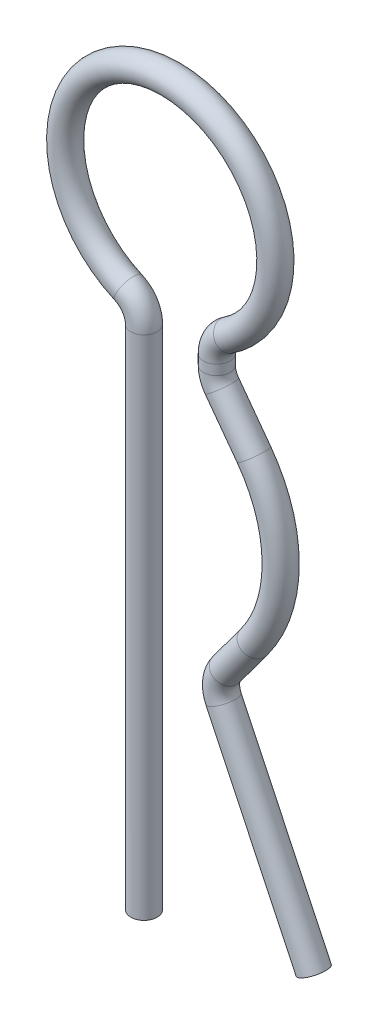
ISO-10303-21;
HEADER;
FILE_DESCRIPTION(('STEP AP214'),'2;1');
FILE_NAME('part.step','',(''),(''),'','','');
FILE_SCHEMA(('AUTOMOTIVE_DESIGN { 1 0 10303 214 1 1 1 1 }'));
ENDSEC;
DATA;
#1=APPLICATION_CONTEXT('core data for automotive mechanical design processes');
#2=APPLICATION_PROTOCOL_DEFINITION('international standard','automotive_design',2000,#1);
#3=PRODUCT_CONTEXT('',#1,'mechanical');
#4=PRODUCT('Part','Part','',(#3));
#5=PRODUCT_RELATED_PRODUCT_CATEGORY('part','',(#4));
#6=PRODUCT_DEFINITION_FORMATION('','',#4);
#7=PRODUCT_DEFINITION_CONTEXT('part definition',#1,'design');
#8=PRODUCT_DEFINITION('design','',#6,#7);
#9=PRODUCT_DEFINITION_SHAPE('','',#8);
#10=(LENGTH_UNIT() NAMED_UNIT(*) SI_UNIT(.MILLI.,.METRE.));
#11=(NAMED_UNIT(*) PLANE_ANGLE_UNIT() SI_UNIT($,.RADIAN.));
#12=(NAMED_UNIT(*) SI_UNIT($,.STERADIAN.) SOLID_ANGLE_UNIT());
#13=UNCERTAINTY_MEASURE_WITH_UNIT(LENGTH_MEASURE(1.E-05),#10,'distance_accuracy_value','');
#14=(GEOMETRIC_REPRESENTATION_CONTEXT(3) GLOBAL_UNCERTAINTY_ASSIGNED_CONTEXT((#13)) GLOBAL_UNIT_ASSIGNED_CONTEXT((#10,
#11,#12)) REPRESENTATION_CONTEXT('',''));
#15=CARTESIAN_POINT('',(0.,0.,0.));
#16=DIRECTION('',(0.,0.,1.));
#17=DIRECTION('',(1.,0.,0.));
#18=AXIS2_PLACEMENT_3D('',#15,#16,#17);
#19=CARTESIAN_POINT('',(1.51338467965908,-2.7721512833438,0.));
#20=DIRECTION('',(0.42874959723389,-0.903423368566353,0.));
#21=DIRECTION('',(0.903423368566353,0.42874959723389,0.));
#22=AXIS2_PLACEMENT_3D('',#19,#20,#21);
#23=CYLINDRICAL_SURFACE('',#22,0.25);
#24=CARTESIAN_POINT('',(1.51338467965908,-2.7721512833438,0.));
#25=DIRECTION('',(0.428749597233998,-0.903423368566302,0.));
#26=DIRECTION('',(0.,0.,1.));
#27=AXIS2_PLACEMENT_3D('',#24,#25,#26);
#28=CIRCLE('',#27,0.25);
#29=CARTESIAN_POINT('',(1.2875288375175,-2.87933868265228,0.));
#30=VERTEX_POINT('',#29);
#31=EDGE_CURVE('E35',#30,#30,#28,.T.);
#32=ORIENTED_EDGE('',*,*,#31,.T.);
#33=EDGE_LOOP('',(#32));
#34=FACE_BOUND('',#33,.T.);
#35=CARTESIAN_POINT('',(3.22838306859465,-6.38584475760921,0.));
#36=DIRECTION('',(0.428749597233998,-0.903423368566302,0.));
#37=DIRECTION('',(0.,0.,1.));
#38=AXIS2_PLACEMENT_3D('',#35,#36,#37);
#39=CIRCLE('',#38,0.25);
#40=CARTESIAN_POINT('',(3.22838306859465,-6.38584475760921,0.25));
#41=VERTEX_POINT('',#40);
#42=EDGE_CURVE('E10',#41,#41,#39,.T.);
#43=ORIENTED_EDGE('',*,*,#42,.F.);
#44=EDGE_LOOP('',(#43));
#45=FACE_BOUND('',#44,.T.);
#46=ADVANCED_FACE('F29',(#34,#45),#23,.T.);
#47=CARTESIAN_POINT('',(1.96509636394225,-2.55777648472683,0.));
#48=DIRECTION('',(0.,0.,1.));
#49=DIRECTION('',(1.,0.,0.));
#50=AXIS2_PLACEMENT_3D('',#47,#48,#49);
#51=TOROIDAL_SURFACE('',#50,0.499999999999999,0.25);
#52=CARTESIAN_POINT('',(1.56280697844019,-2.26085351439214,0.));
#53=DIRECTION('',(-0.593845940669336,-0.804578771004152,0.));
#54=DIRECTION('',(0.,0.,1.));
#55=AXIS2_PLACEMENT_3D('',#52,#53,#54);
#56=CIRCLE('',#55,0.25);
#57=CARTESIAN_POINT('',(1.36166228568916,-2.11239202922479,0.));
#58=VERTEX_POINT('',#57);
#59=EDGE_CURVE('E39',#58,#58,#56,.T.);
#60=CARTESIAN_POINT('',(1.96509636394225,-2.55777648472683,0.));
#61=DIRECTION('',(0.,0.,1.));
#62=DIRECTION('',(1.,0.,0.));
#63=AXIS2_PLACEMENT_3D('',#60,#61,#62);
#64=CIRCLE('',#63,0.749999999999999);
#65=EDGE_CURVE('',#58,#30,#64,.T.);
#66=ORIENTED_EDGE('',*,*,#59,.T.);
#67=ORIENTED_EDGE('',*,*,#31,.F.);
#68=ORIENTED_EDGE('',*,*,#65,.T.);
#69=ORIENTED_EDGE('',*,*,#65,.F.);
#70=EDGE_LOOP('',(#66,#68,#67,#69));
#71=FACE_BOUND('',#70,.T.);
#72=ADVANCED_FACE('F84',(#71),#51,.T.);
#73=CARTESIAN_POINT('',(2.0919048046107,-1.54399944574041,0.));
#74=DIRECTION('',(-0.593845940669432,-0.804578771004081,0.));
#75=DIRECTION('',(0.804578771004081,-0.593845940669432,0.));
#76=AXIS2_PLACEMENT_3D('',#73,#74,#75);
#77=CYLINDRICAL_SURFACE('',#76,0.25);
#78=CARTESIAN_POINT('',(2.0919048046107,-1.54399944574041,0.));
#79=DIRECTION('',(-0.593845940669336,-0.804578771004152,0.));
#80=DIRECTION('',(0.,0.,1.));
#81=AXIS2_PLACEMENT_3D('',#78,#79,#80);
#82=CIRCLE('',#81,0.25);
#83=CARTESIAN_POINT('',(2.29304949736173,-1.69246093090775,0.));
#84=VERTEX_POINT('',#83);
#85=EDGE_CURVE('E43',#84,#84,#82,.T.);
#86=ORIENTED_EDGE('',*,*,#85,.T.);
#87=EDGE_LOOP('',(#86));
#88=FACE_BOUND('',#87,.T.);
#89=ORIENTED_EDGE('',*,*,#59,.F.);
#90=EDGE_LOOP('',(#89));
#91=FACE_BOUND('',#90,.T.);
#92=ADVANCED_FACE('F88',(#88,#91),#77,.T.);
#93=CARTESIAN_POINT('',(0.,0.,0.));
#94=DIRECTION('',(0.,0.,-1.));
#95=DIRECTION('',(-1.,0.,0.));
#96=AXIS2_PLACEMENT_3D('',#93,#94,#95);
#97=TOROIDAL_SURFACE('',#96,2.6,0.25);
#98=CARTESIAN_POINT('',(2.09190480461073,1.54399944574036,0.));
#99=DIRECTION('',(0.59384594066942,-0.80457877100409,0.));
#100=DIRECTION('',(0.,0.,1.));
#101=AXIS2_PLACEMENT_3D('',#98,#99,#100);
#102=CIRCLE('',#101,0.25);
#103=CARTESIAN_POINT('',(2.29304949736176,1.6924609309077,0.));
#104=VERTEX_POINT('',#103);
#105=EDGE_CURVE('E48',#104,#104,#102,.T.);
#106=CARTESIAN_POINT('',(0.,0.,0.));
#107=DIRECTION('',(0.,0.,-1.));
#108=DIRECTION('',(-1.,0.,0.));
#109=AXIS2_PLACEMENT_3D('',#106,#107,#108);
#110=CIRCLE('',#109,2.85);
#111=EDGE_CURVE('',#104,#84,#110,.T.);
#112=ORIENTED_EDGE('',*,*,#105,.T.);
#113=ORIENTED_EDGE('',*,*,#85,.F.);
#114=ORIENTED_EDGE('',*,*,#111,.T.);
#115=ORIENTED_EDGE('',*,*,#111,.F.);
#116=EDGE_LOOP('',(#112,#114,#113,#115));
#117=FACE_BOUND('',#116,.T.);
#118=ADVANCED_FACE('F94',(#117),#97,.T.);
#119=CARTESIAN_POINT('',(1.48274726260262,2.36932330994705,0.));
#120=DIRECTION('',(0.593845940669433,-0.80457877100408,0.));
#121=DIRECTION('',(0.80457877100408,0.593845940669433,0.));
#122=AXIS2_PLACEMENT_3D('',#119,#120,#121);
#123=CYLINDRICAL_SURFACE('',#122,0.25);
#124=CARTESIAN_POINT('',(1.48274726260262,2.36932330994705,0.));
#125=DIRECTION('',(0.59384594066942,-0.80457877100409,0.));
#126=DIRECTION('',(0.,0.,1.));
#127=AXIS2_PLACEMENT_3D('',#124,#125,#126);
#128=CIRCLE('',#127,0.25);
#129=CARTESIAN_POINT('',(1.28160256985161,2.22086182477968,0.));
#130=VERTEX_POINT('',#129);
#131=EDGE_CURVE('E51',#130,#130,#128,.T.);
#132=ORIENTED_EDGE('',*,*,#131,.T.);
#133=EDGE_LOOP('',(#132));
#134=FACE_BOUND('',#133,.T.);
#135=ORIENTED_EDGE('',*,*,#105,.F.);
#136=EDGE_LOOP('',(#135));
#137=FACE_BOUND('',#136,.T.);
#138=ADVANCED_FACE('F101',(#134,#137),#123,.T.);
#139=CARTESIAN_POINT('',(1.88503664810465,2.66624628028178,0.));
#140=DIRECTION('',(0.,0.,1.));
#141=DIRECTION('',(1.,0.,0.));
#142=AXIS2_PLACEMENT_3D('',#139,#140,#141);
#143=TOROIDAL_SURFACE('',#142,0.5,0.25);
#144=CARTESIAN_POINT('',(1.38503664810465,2.66624628028176,0.));
#145=DIRECTION('',(0.,-1.,0.));
#146=DIRECTION('',(0.,0.,1.));
#147=AXIS2_PLACEMENT_3D('',#144,#145,#146);
#148=CIRCLE('',#147,0.25);
#149=CARTESIAN_POINT('',(1.13503664810465,2.66624628028174,0.));
#150=VERTEX_POINT('',#149);
#151=EDGE_CURVE('E54',#150,#150,#148,.T.);
#152=CARTESIAN_POINT('',(1.88503664810465,2.66624628028178,0.));
#153=DIRECTION('',(0.,0.,1.));
#154=DIRECTION('',(1.,0.,0.));
#155=AXIS2_PLACEMENT_3D('',#152,#153,#154);
#156=CIRCLE('',#155,0.75);
#157=EDGE_CURVE('',#150,#130,#156,.T.);
#158=ORIENTED_EDGE('',*,*,#151,.T.);
#159=ORIENTED_EDGE('',*,*,#131,.F.);
#160=ORIENTED_EDGE('',*,*,#157,.T.);
#161=ORIENTED_EDGE('',*,*,#157,.F.);
#162=EDGE_LOOP('',(#158,#160,#159,#161));
#163=FACE_BOUND('',#162,.T.);
#164=ADVANCED_FACE('F105',(#163),#143,.T.);
#165=CARTESIAN_POINT('',(1.38503664810465,2.85522439487942,0.));
#166=DIRECTION('',(0.,-1.,0.));
#167=DIRECTION('',(1.,0.,0.));
#168=AXIS2_PLACEMENT_3D('',#165,#166,#167);
#169=CYLINDRICAL_SURFACE('',#168,0.25);
#170=CARTESIAN_POINT('',(1.38503664810465,2.85522439487942,0.));
#171=DIRECTION('',(0.,-1.,0.));
#172=DIRECTION('',(0.,0.,1.));
#173=AXIS2_PLACEMENT_3D('',#170,#171,#172);
#174=CIRCLE('',#173,0.25);
#175=CARTESIAN_POINT('',(1.13503664810465,2.8552243948794,0.));
#176=VERTEX_POINT('',#175);
#177=EDGE_CURVE('E57',#176,#176,#174,.T.);
#178=ORIENTED_EDGE('',*,*,#177,.T.);
#179=EDGE_LOOP('',(#178));
#180=FACE_BOUND('',#179,.T.);
#181=ORIENTED_EDGE('',*,*,#151,.F.);
#182=EDGE_LOOP('',(#181));
#183=FACE_BOUND('',#182,.T.);
#184=ADVANCED_FACE('F109',(#180,#183),#169,.T.);
#185=CARTESIAN_POINT('',(1.88503664810465,2.85522439487944,0.));
#186=DIRECTION('',(0.,0.,1.));
#187=DIRECTION('',(1.,0.,0.));
#188=AXIS2_PLACEMENT_3D('',#185,#186,#187);
#189=TOROIDAL_SURFACE('',#188,0.5,0.25);
#190=CARTESIAN_POINT('',(1.60802931848369,3.27147785052428,0.));
#191=DIRECTION('',(-0.832506911289714,-0.554014659241847,0.));
#192=DIRECTION('',(0.,0.,1.));
#193=AXIS2_PLACEMENT_3D('',#190,#191,#192);
#194=CIRCLE('',#193,0.25);
#195=CARTESIAN_POINT('',(1.46952565367322,3.4796045783467,0.));
#196=VERTEX_POINT('',#195);
#197=EDGE_CURVE('E60',#196,#196,#194,.T.);
#198=CARTESIAN_POINT('',(1.88503664810465,2.85522439487944,0.));
#199=DIRECTION('',(0.,0.,1.));
#200=DIRECTION('',(1.,0.,0.));
#201=AXIS2_PLACEMENT_3D('',#198,#199,#200);
#202=CIRCLE('',#201,0.75);
#203=EDGE_CURVE('',#196,#176,#202,.T.);
#204=ORIENTED_EDGE('',*,*,#197,.T.);
#205=ORIENTED_EDGE('',*,*,#177,.F.);
#206=ORIENTED_EDGE('',*,*,#203,.T.);
#207=ORIENTED_EDGE('',*,*,#203,.F.);
#208=EDGE_LOOP('',(#204,#206,#205,#207));
#209=FACE_BOUND('',#208,.T.);
#210=ADVANCED_FACE('F113',(#209),#189,.T.);
#211=CARTESIAN_POINT('',(0.499999999999999,4.93649167310371,0.));
#212=DIRECTION('',(0.,0.,-1.));
#213=DIRECTION('',(-1.,0.,0.));
#214=AXIS2_PLACEMENT_3D('',#211,#212,#213);
#215=TOROIDAL_SURFACE('',#214,2.,0.25);
#216=CARTESIAN_POINT('',(-0.3,3.10346139512137,0.));
#217=DIRECTION('',(-0.916515138991168,0.4,0.));
#218=DIRECTION('',(0.,0.,1.));
#219=AXIS2_PLACEMENT_3D('',#216,#217,#218);
#220=CIRCLE('',#219,0.25);
#221=CARTESIAN_POINT('',(-0.2,3.33259017986916,0.));
#222=VERTEX_POINT('',#221);
#223=EDGE_CURVE('E63',#222,#222,#220,.T.);
#224=ORIENTED_EDGE('',*,*,#223,.T.);
#225=EDGE_LOOP('',(#224));
#226=FACE_BOUND('',#225,.T.);
#227=ORIENTED_EDGE('',*,*,#197,.F.);
#228=EDGE_LOOP('',(#227));
#229=FACE_BOUND('',#228,.T.);
#230=ADVANCED_FACE('F117',(#226,#229),#215,.T.);
#231=CARTESIAN_POINT('',(-0.5,2.64520382562579,0.));
#232=DIRECTION('',(0.,0.,1.));
#233=DIRECTION('',(1.,0.,0.));
#234=AXIS2_PLACEMENT_3D('',#231,#232,#233);
#235=TOROIDAL_SURFACE('',#234,0.5,0.25);
#236=CARTESIAN_POINT('',(0.,2.64520382562579,0.));
#237=DIRECTION('',(0.,1.,0.));
#238=DIRECTION('',(0.,0.,1.));
#239=AXIS2_PLACEMENT_3D('',#236,#237,#238);
#240=CIRCLE('',#239,0.25);
#241=CARTESIAN_POINT('',(0.25,2.64520382562579,0.));
#242=VERTEX_POINT('',#241);
#243=EDGE_CURVE('E66',#242,#242,#240,.T.);
#244=CARTESIAN_POINT('',(-0.5,2.64520382562579,0.));
#245=DIRECTION('',(0.,0.,1.));
#246=DIRECTION('',(1.,0.,0.));
#247=AXIS2_PLACEMENT_3D('',#244,#245,#246);
#248=CIRCLE('',#247,0.75);
#249=EDGE_CURVE('',#242,#222,#248,.T.);
#250=ORIENTED_EDGE('',*,*,#243,.T.);
#251=ORIENTED_EDGE('',*,*,#223,.F.);
#252=ORIENTED_EDGE('',*,*,#249,.T.);
#253=ORIENTED_EDGE('',*,*,#249,.F.);
#254=EDGE_LOOP('',(#250,#252,#251,#253));
#255=FACE_BOUND('',#254,.T.);
#256=ADVANCED_FACE('F121',(#255),#235,.T.);
#257=CARTESIAN_POINT('',(0.,2.64520382562579,0.));
#258=DIRECTION('',(0.,-1.,0.));
#259=DIRECTION('',(0.,0.,-1.));
#260=AXIS2_PLACEMENT_3D('',#257,#258,#259);
#261=CYLINDRICAL_SURFACE('',#260,0.25);
#262=ORIENTED_EDGE('',*,*,#243,.F.);
#263=EDGE_LOOP('',(#262));
#264=FACE_BOUND('',#263,.T.);
#265=CARTESIAN_POINT('',(0.,-7.,0.));
#266=DIRECTION('',(0.,1.,0.));
#267=DIRECTION('',(0.,0.,1.));
#268=AXIS2_PLACEMENT_3D('',#265,#266,#267);
#269=CIRCLE('',#268,0.25);
#270=CARTESIAN_POINT('',(0.,-7.,0.25));
#271=VERTEX_POINT('',#270);
#272=EDGE_CURVE('E69',#271,#271,#269,.T.);
#273=ORIENTED_EDGE('',*,*,#272,.T.);
#274=EDGE_LOOP('',(#273));
#275=FACE_BOUND('',#274,.T.);
#276=ADVANCED_FACE('F73',(#264,#275),#261,.T.);
#277=CARTESIAN_POINT('',(3.22838306859465,-6.38584475760921,0.));
#278=DIRECTION('',(0.428749597233998,-0.903423368566302,0.));
#279=DIRECTION('',(0.,0.,1.));
#280=AXIS2_PLACEMENT_3D('',#277,#278,#279);
#281=PLANE('',#280);
#282=ORIENTED_EDGE('',*,*,#42,.T.);
#283=EDGE_LOOP('',(#282));
#284=FACE_BOUND('',#283,.T.);
#285=ADVANCED_FACE('F77',(#284),#281,.T.);
#286=CARTESIAN_POINT('',(0.,-7.,0.));
#287=DIRECTION('',(0.,1.,0.));
#288=DIRECTION('',(0.,0.,1.));
#289=AXIS2_PLACEMENT_3D('',#286,#287,#288);
#290=PLANE('',#289);
#291=ORIENTED_EDGE('',*,*,#272,.F.);
#292=EDGE_LOOP('',(#291));
#293=FACE_BOUND('',#292,.T.);
#294=ADVANCED_FACE('F75',(#293),#290,.F.);
#295=CLOSED_SHELL('',(#46,#72,#92,#118,#138,#164,#184,#210,#230,#256,#276,#285,#294));
#296=MANIFOLD_SOLID_BREP('B2',#295);
#297=ADVANCED_BREP_SHAPE_REPRESENTATION('',(#18,#296),#14);
#298=SHAPE_DEFINITION_REPRESENTATION(#9,#297);
ENDSEC;
END-ISO-10303-21;
